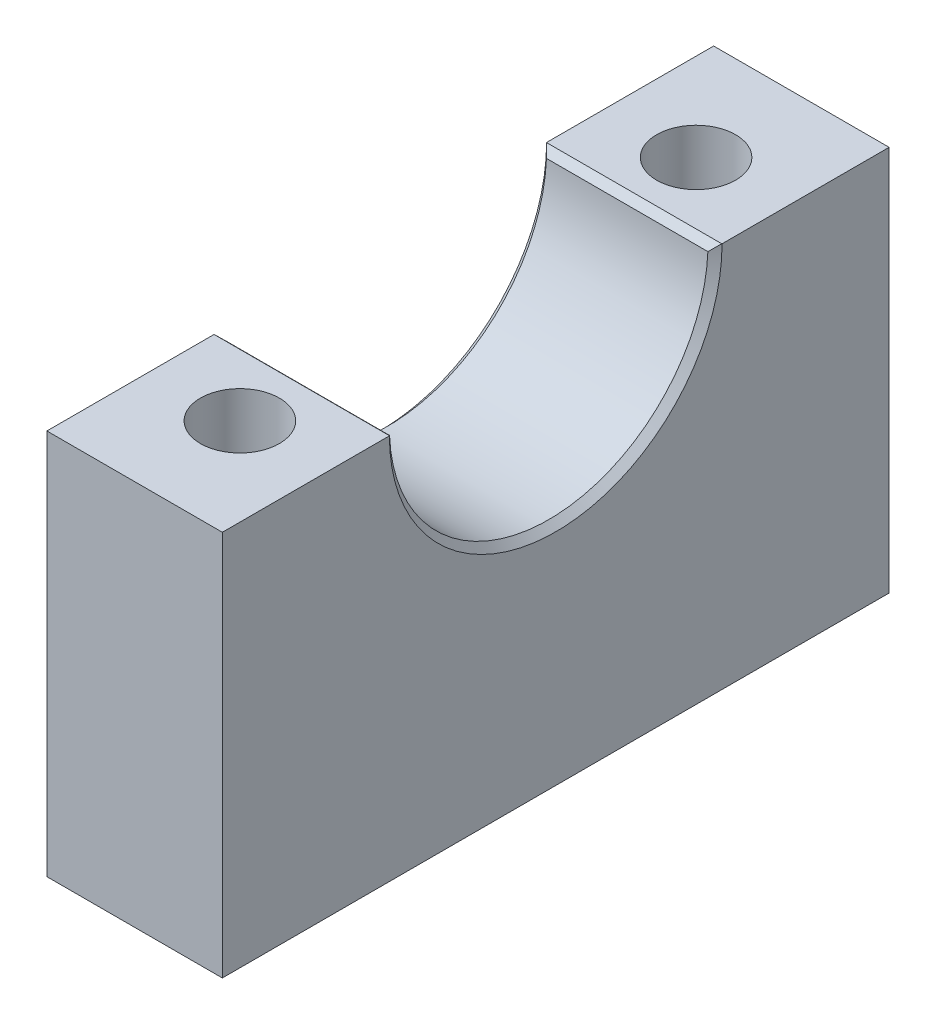
ISO-10303-21;
HEADER;
FILE_DESCRIPTION(('STEP AP214'),'2;1');
FILE_NAME('part.step','',(''),(''),'','','');
FILE_SCHEMA(('AUTOMOTIVE_DESIGN { 1 0 10303 214 1 1 1 1 }'));
ENDSEC;
DATA;
#1=APPLICATION_CONTEXT('core data for automotive mechanical design processes');
#2=APPLICATION_PROTOCOL_DEFINITION('international standard','automotive_design',2000,#1);
#3=PRODUCT_CONTEXT('',#1,'mechanical');
#4=PRODUCT('Part','Part','',(#3));
#5=PRODUCT_RELATED_PRODUCT_CATEGORY('part','',(#4));
#6=PRODUCT_DEFINITION_FORMATION('','',#4);
#7=PRODUCT_DEFINITION_CONTEXT('part definition',#1,'design');
#8=PRODUCT_DEFINITION('design','',#6,#7);
#9=PRODUCT_DEFINITION_SHAPE('','',#8);
#10=(LENGTH_UNIT() NAMED_UNIT(*) SI_UNIT(.MILLI.,.METRE.));
#11=(NAMED_UNIT(*) PLANE_ANGLE_UNIT() SI_UNIT($,.RADIAN.));
#12=(NAMED_UNIT(*) SI_UNIT($,.STERADIAN.) SOLID_ANGLE_UNIT());
#13=UNCERTAINTY_MEASURE_WITH_UNIT(LENGTH_MEASURE(1.E-05),#10,'distance_accuracy_value','');
#14=(GEOMETRIC_REPRESENTATION_CONTEXT(3) GLOBAL_UNCERTAINTY_ASSIGNED_CONTEXT((#13)) GLOBAL_UNIT_ASSIGNED_CONTEXT((#10,
#11,#12)) REPRESENTATION_CONTEXT('',''));
#15=CARTESIAN_POINT('',(0.,0.,0.));
#16=DIRECTION('',(0.,0.,1.));
#17=DIRECTION('',(1.,0.,0.));
#18=AXIS2_PLACEMENT_3D('',#15,#16,#17);
#19=CARTESIAN_POINT('',(15.875,0.,0.));
#20=DIRECTION('',(-1.,0.,0.));
#21=DIRECTION('',(0.,0.,1.));
#22=AXIS2_PLACEMENT_3D('',#19,#20,#21);
#23=CYLINDRICAL_SURFACE('',#22,14.4145);
#24=CARTESIAN_POINT('',(15.24,0.,0.));
#25=DIRECTION('',(1.,0.,0.));
#26=DIRECTION('',(0.,0.,-1.));
#27=AXIS2_PLACEMENT_3D('',#24,#25,#26);
#28=CIRCLE('',#27,14.4145);
#29=CARTESIAN_POINT('',(15.24,-0.608206751054859,14.4016629178012));
#30=VERTEX_POINT('',#29);
#31=CARTESIAN_POINT('',(15.24,-0.608206751054859,-14.4016629178012));
#32=VERTEX_POINT('',#31);
#33=EDGE_CURVE('E180',#30,#32,#28,.T.);
#34=ORIENTED_EDGE('',*,*,#33,.T.);
#35=DIRECTION('',(-1.,0.,0.));
#36=VECTOR('',#35,1.);
#37=CARTESIAN_POINT('',(15.875,-0.608206751054859,-14.4016629178012));
#38=LINE('',#37,#36);
#39=CARTESIAN_POINT('',(0.635000000000006,-0.608206751054859,-14.4016629178012));
#40=VERTEX_POINT('',#39);
#41=EDGE_CURVE('E182',#32,#40,#38,.T.);
#42=ORIENTED_EDGE('',*,*,#41,.T.);
#43=CARTESIAN_POINT('',(0.635000000000005,0.,0.));
#44=DIRECTION('',(1.,0.,0.));
#45=DIRECTION('',(0.,0.,-1.));
#46=AXIS2_PLACEMENT_3D('',#43,#44,#45);
#47=CIRCLE('',#46,14.4145);
#48=CARTESIAN_POINT('',(0.635000000000006,-0.608206751054859,14.4016629178012));
#49=VERTEX_POINT('',#48);
#50=EDGE_CURVE('E135',#40,#49,#47,.F.);
#51=ORIENTED_EDGE('',*,*,#50,.T.);
#52=DIRECTION('',(-1.,0.,0.));
#53=VECTOR('',#52,1.);
#54=CARTESIAN_POINT('',(15.875,-0.608206751054859,14.4016629178012));
#55=LINE('',#54,#53);
#56=EDGE_CURVE('E178',#49,#30,#55,.F.);
#57=ORIENTED_EDGE('',*,*,#56,.T.);
#58=EDGE_LOOP('',(#34,#42,#51,#57));
#59=FACE_BOUND('',#58,.T.);
#60=ADVANCED_FACE('F45',(#59),#23,.F.);
#61=CARTESIAN_POINT('',(15.875,0.,0.));
#62=DIRECTION('',(0.,1.,0.));
#63=DIRECTION('',(0.,0.,1.));
#64=AXIS2_PLACEMENT_3D('',#61,#62,#63);
#65=PLANE('',#64);
#66=CARTESIAN_POINT('',(7.93750000000001,0.,20.6375));
#67=DIRECTION('',(0.,1.,0.));
#68=DIRECTION('',(0.,0.,1.));
#69=AXIS2_PLACEMENT_3D('',#66,#67,#68);
#70=CIRCLE('',#69,3.57123999999999);
#71=CARTESIAN_POINT('',(7.93750000000001,0.,24.20874));
#72=VERTEX_POINT('',#71);
#73=EDGE_CURVE('E275',#72,#72,#70,.T.);
#74=ORIENTED_EDGE('',*,*,#73,.F.);
#75=EDGE_LOOP('',(#74));
#76=FACE_BOUND('',#75,.T.);
#77=DIRECTION('',(0.,0.,-1.));
#78=VECTOR('',#77,1.);
#79=CARTESIAN_POINT('',(15.875,0.,0.));
#80=LINE('',#79,#78);
#81=CARTESIAN_POINT('',(15.875,0.,30.1625));
#82=VERTEX_POINT('',#81);
#83=CARTESIAN_POINT('',(15.875,0.,15.0495));
#84=VERTEX_POINT('',#83);
#85=EDGE_CURVE('E128',#82,#84,#80,.T.);
#86=ORIENTED_EDGE('',*,*,#85,.T.);
#87=DIRECTION('',(0.707106781186544,0.,0.707106781186551));
#88=VECTOR('',#87,1.);
#89=CARTESIAN_POINT('',(0.825500000000151,0.,0.));
#90=LINE('',#89,#88);
#91=CARTESIAN_POINT('',(15.8615974075722,0.,15.0360974075722));
#92=VERTEX_POINT('',#91);
#93=EDGE_CURVE('E60',#84,#92,#90,.F.);
#94=ORIENTED_EDGE('',*,*,#93,.T.);
#95=DIRECTION('',(-1.,0.,0.));
#96=VECTOR('',#95,1.);
#97=CARTESIAN_POINT('',(15.875,0.,15.0360974075722));
#98=LINE('',#97,#96);
#99=CARTESIAN_POINT('',(0.0134025924277796,0.,15.0360974075722));
#100=VERTEX_POINT('',#99);
#101=EDGE_CURVE('E71',#92,#100,#98,.T.);
#102=ORIENTED_EDGE('',*,*,#101,.T.);
#103=DIRECTION('',(0.707106781186544,0.,-0.707106781186551));
#104=VECTOR('',#103,1.);
#105=CARTESIAN_POINT('',(15.0494999999998,0.,0.));
#106=LINE('',#105,#104);
#107=CARTESIAN_POINT('',(0.,0.,15.0495));
#108=VERTEX_POINT('',#107);
#109=EDGE_CURVE('E193',#100,#108,#106,.F.);
#110=ORIENTED_EDGE('',*,*,#109,.T.);
#111=DIRECTION('',(0.,0.,-1.));
#112=VECTOR('',#111,1.);
#113=CARTESIAN_POINT('',(0.,0.,0.));
#114=LINE('',#113,#112);
#115=CARTESIAN_POINT('',(0.,0.,30.1625));
#116=VERTEX_POINT('',#115);
#117=EDGE_CURVE('E130',#116,#108,#114,.T.);
#118=ORIENTED_EDGE('',*,*,#117,.F.);
#119=DIRECTION('',(-1.,0.,0.));
#120=VECTOR('',#119,1.);
#121=CARTESIAN_POINT('',(15.875,0.,30.1625));
#122=LINE('',#121,#120);
#123=EDGE_CURVE('E125',#82,#116,#122,.T.);
#124=ORIENTED_EDGE('',*,*,#123,.F.);
#125=EDGE_LOOP('',(#86,#94,#102,#110,#118,#124));
#126=FACE_BOUND('',#125,.T.);
#127=ADVANCED_FACE('F127',(#76,#126),#65,.T.);
#128=CARTESIAN_POINT('',(15.875,0.,30.1625));
#129=DIRECTION('',(0.,0.,1.));
#130=DIRECTION('',(1.,0.,0.));
#131=AXIS2_PLACEMENT_3D('',#128,#129,#130);
#132=PLANE('',#131);
#133=DIRECTION('',(0.,1.,0.));
#134=VECTOR('',#133,1.);
#135=CARTESIAN_POINT('',(0.,0.,30.1625));
#136=LINE('',#135,#134);
#137=CARTESIAN_POINT('',(0.,-34.925,30.1625));
#138=VERTEX_POINT('',#137);
#139=EDGE_CURVE('E159',#138,#116,#136,.T.);
#140=ORIENTED_EDGE('',*,*,#139,.F.);
#141=DIRECTION('',(-1.,0.,0.));
#142=VECTOR('',#141,1.);
#143=CARTESIAN_POINT('',(15.875,-34.925,30.1625));
#144=LINE('',#143,#142);
#145=CARTESIAN_POINT('',(15.875,-34.925,30.1625));
#146=VERTEX_POINT('',#145);
#147=EDGE_CURVE('E136',#146,#138,#144,.T.);
#148=ORIENTED_EDGE('',*,*,#147,.F.);
#149=DIRECTION('',(0.,1.,0.));
#150=VECTOR('',#149,1.);
#151=CARTESIAN_POINT('',(15.875,0.,30.1625));
#152=LINE('',#151,#150);
#153=EDGE_CURVE('E142',#146,#82,#152,.T.);
#154=ORIENTED_EDGE('',*,*,#153,.T.);
#155=ORIENTED_EDGE('',*,*,#123,.T.);
#156=EDGE_LOOP('',(#140,#148,#154,#155));
#157=FACE_BOUND('',#156,.T.);
#158=ADVANCED_FACE('F148',(#157),#132,.T.);
#159=CARTESIAN_POINT('',(15.875,-34.925,0.));
#160=DIRECTION('',(0.,1.,0.));
#161=DIRECTION('',(0.,0.,1.));
#162=AXIS2_PLACEMENT_3D('',#159,#160,#161);
#163=PLANE('',#162);
#164=CARTESIAN_POINT('',(7.93750000000001,-34.925,20.6375));
#165=DIRECTION('',(0.,1.,0.));
#166=DIRECTION('',(0.,0.,1.));
#167=AXIS2_PLACEMENT_3D('',#164,#165,#166);
#168=CIRCLE('',#167,3.57123999999998);
#169=CARTESIAN_POINT('',(7.93750000000001,-34.925,24.20874));
#170=VERTEX_POINT('',#169);
#171=EDGE_CURVE('E278',#170,#170,#168,.T.);
#172=ORIENTED_EDGE('',*,*,#171,.T.);
#173=EDGE_LOOP('',(#172));
#174=FACE_BOUND('',#173,.T.);
#175=CARTESIAN_POINT('',(7.9375,-34.925,-20.6375));
#176=DIRECTION('',(0.,1.,0.));
#177=DIRECTION('',(0.,0.,1.));
#178=AXIS2_PLACEMENT_3D('',#175,#176,#177);
#179=CIRCLE('',#178,3.57123999999998);
#180=CARTESIAN_POINT('',(7.9375,-34.925,-17.06626));
#181=VERTEX_POINT('',#180);
#182=EDGE_CURVE('E176',#181,#181,#179,.T.);
#183=ORIENTED_EDGE('',*,*,#182,.T.);
#184=EDGE_LOOP('',(#183));
#185=FACE_BOUND('',#184,.T.);
#186=DIRECTION('',(0.,0.,-1.));
#187=VECTOR('',#186,1.);
#188=CARTESIAN_POINT('',(0.,-34.925,0.));
#189=LINE('',#188,#187);
#190=CARTESIAN_POINT('',(0.,-34.925,-30.1625));
#191=VERTEX_POINT('',#190);
#192=EDGE_CURVE('E162',#138,#191,#189,.T.);
#193=ORIENTED_EDGE('',*,*,#192,.T.);
#194=DIRECTION('',(-1.,0.,0.));
#195=VECTOR('',#194,1.);
#196=CARTESIAN_POINT('',(15.875,-34.925,-30.1625));
#197=LINE('',#196,#195);
#198=CARTESIAN_POINT('',(15.875,-34.925,-30.1625));
#199=VERTEX_POINT('',#198);
#200=EDGE_CURVE('E170',#199,#191,#197,.T.);
#201=ORIENTED_EDGE('',*,*,#200,.F.);
#202=DIRECTION('',(0.,0.,-1.));
#203=VECTOR('',#202,1.);
#204=CARTESIAN_POINT('',(15.875,-34.925,0.));
#205=LINE('',#204,#203);
#206=EDGE_CURVE('E150',#146,#199,#205,.T.);
#207=ORIENTED_EDGE('',*,*,#206,.F.);
#208=ORIENTED_EDGE('',*,*,#147,.T.);
#209=EDGE_LOOP('',(#193,#201,#207,#208));
#210=FACE_BOUND('',#209,.T.);
#211=ADVANCED_FACE('F249',(#174,#185,#210),#163,.F.);
#212=CARTESIAN_POINT('',(15.875,0.,-30.1625));
#213=DIRECTION('',(0.,0.,1.));
#214=DIRECTION('',(1.,0.,0.));
#215=AXIS2_PLACEMENT_3D('',#212,#213,#214);
#216=PLANE('',#215);
#217=DIRECTION('',(0.,1.,0.));
#218=VECTOR('',#217,1.);
#219=CARTESIAN_POINT('',(0.,0.,-30.1625));
#220=LINE('',#219,#218);
#221=CARTESIAN_POINT('',(0.,0.,-30.1625));
#222=VERTEX_POINT('',#221);
#223=EDGE_CURVE('E164',#191,#222,#220,.T.);
#224=ORIENTED_EDGE('',*,*,#223,.T.);
#225=DIRECTION('',(-1.,0.,0.));
#226=VECTOR('',#225,1.);
#227=CARTESIAN_POINT('',(15.875,0.,-30.1625));
#228=LINE('',#227,#226);
#229=CARTESIAN_POINT('',(15.875,0.,-30.1625));
#230=VERTEX_POINT('',#229);
#231=EDGE_CURVE('E167',#230,#222,#228,.T.);
#232=ORIENTED_EDGE('',*,*,#231,.F.);
#233=DIRECTION('',(0.,1.,0.));
#234=VECTOR('',#233,1.);
#235=CARTESIAN_POINT('',(15.875,0.,-30.1625));
#236=LINE('',#235,#234);
#237=EDGE_CURVE('E152',#199,#230,#236,.T.);
#238=ORIENTED_EDGE('',*,*,#237,.F.);
#239=ORIENTED_EDGE('',*,*,#200,.T.);
#240=EDGE_LOOP('',(#224,#232,#238,#239));
#241=FACE_BOUND('',#240,.T.);
#242=ADVANCED_FACE('F252',(#241),#216,.F.);
#243=CARTESIAN_POINT('',(7.9375,0.,-20.6375));
#244=DIRECTION('',(0.,1.,0.));
#245=DIRECTION('',(0.,0.,1.));
#246=AXIS2_PLACEMENT_3D('',#243,#244,#245);
#247=CIRCLE('',#246,3.57123999999999);
#248=CARTESIAN_POINT('',(7.9375,0.,-17.06626));
#249=VERTEX_POINT('',#248);
#250=EDGE_CURVE('E160',#249,#249,#247,.T.);
#251=ORIENTED_EDGE('',*,*,#250,.F.);
#252=EDGE_LOOP('',(#251));
#253=FACE_BOUND('',#252,.T.);
#254=DIRECTION('',(1.,0.,0.));
#255=VECTOR('',#254,1.);
#256=CARTESIAN_POINT('',(15.875,0.,-15.0360974075722));
#257=LINE('',#256,#255);
#258=CARTESIAN_POINT('',(0.0134025924277796,0.,-15.0360974075722));
#259=VERTEX_POINT('',#258);
#260=CARTESIAN_POINT('',(15.8615974075722,0.,-15.0360974075722));
#261=VERTEX_POINT('',#260);
#262=EDGE_CURVE('E187',#259,#261,#257,.T.);
#263=ORIENTED_EDGE('',*,*,#262,.T.);
#264=DIRECTION('',(-0.707106781186544,0.,0.707106781186551));
#265=VECTOR('',#264,1.);
#266=CARTESIAN_POINT('',(0.825500000000151,0.,0.));
#267=LINE('',#266,#265);
#268=CARTESIAN_POINT('',(15.875,0.,-15.0495));
#269=VERTEX_POINT('',#268);
#270=EDGE_CURVE('E190',#261,#269,#267,.F.);
#271=ORIENTED_EDGE('',*,*,#270,.T.);
#272=EDGE_CURVE('E147',#269,#230,#80,.T.);
#273=ORIENTED_EDGE('',*,*,#272,.T.);
#274=ORIENTED_EDGE('',*,*,#231,.T.);
#275=CARTESIAN_POINT('',(0.,0.,-15.0495));
#276=VERTEX_POINT('',#275);
#277=EDGE_CURVE('E145',#276,#222,#114,.T.);
#278=ORIENTED_EDGE('',*,*,#277,.F.);
#279=DIRECTION('',(-0.707106781186544,0.,-0.707106781186551));
#280=VECTOR('',#279,1.);
#281=CARTESIAN_POINT('',(15.0494999999998,0.,0.));
#282=LINE('',#281,#280);
#283=EDGE_CURVE('E185',#276,#259,#282,.F.);
#284=ORIENTED_EDGE('',*,*,#283,.T.);
#285=EDGE_LOOP('',(#263,#271,#273,#274,#278,#284));
#286=FACE_BOUND('',#285,.T.);
#287=ADVANCED_FACE('F245',(#253,#286),#65,.T.);
#288=CARTESIAN_POINT('',(15.875,0.,0.));
#289=DIRECTION('',(1.,0.,0.));
#290=DIRECTION('',(0.,0.,-1.));
#291=AXIS2_PLACEMENT_3D('',#288,#289,#290);
#292=PLANE('',#291);
#293=ORIENTED_EDGE('',*,*,#272,.F.);
#294=CARTESIAN_POINT('',(15.875,0.,0.));
#295=DIRECTION('',(1.,0.,0.));
#296=DIRECTION('',(0.,0.,-1.));
#297=AXIS2_PLACEMENT_3D('',#294,#295,#296);
#298=CIRCLE('',#297,15.0495);
#299=EDGE_CURVE('E144',#269,#84,#298,.F.);
#300=ORIENTED_EDGE('',*,*,#299,.T.);
#301=ORIENTED_EDGE('',*,*,#85,.F.);
#302=ORIENTED_EDGE('',*,*,#153,.F.);
#303=ORIENTED_EDGE('',*,*,#206,.T.);
#304=ORIENTED_EDGE('',*,*,#237,.T.);
#305=EDGE_LOOP('',(#293,#300,#301,#302,#303,#304));
#306=FACE_BOUND('',#305,.T.);
#307=ADVANCED_FACE('F141',(#306),#292,.T.);
#308=CARTESIAN_POINT('',(0.,0.,0.));
#309=DIRECTION('',(1.,0.,0.));
#310=DIRECTION('',(0.,0.,-1.));
#311=AXIS2_PLACEMENT_3D('',#308,#309,#310);
#312=PLANE('',#311);
#313=ORIENTED_EDGE('',*,*,#117,.T.);
#314=CARTESIAN_POINT('',(0.,0.,0.));
#315=DIRECTION('',(1.,0.,0.));
#316=DIRECTION('',(0.,0.,-1.));
#317=AXIS2_PLACEMENT_3D('',#314,#315,#316);
#318=CIRCLE('',#317,15.0495);
#319=EDGE_CURVE('E12',#108,#276,#318,.T.);
#320=ORIENTED_EDGE('',*,*,#319,.T.);
#321=ORIENTED_EDGE('',*,*,#277,.T.);
#322=ORIENTED_EDGE('',*,*,#223,.F.);
#323=ORIENTED_EDGE('',*,*,#192,.F.);
#324=ORIENTED_EDGE('',*,*,#139,.T.);
#325=EDGE_LOOP('',(#313,#320,#321,#322,#323,#324));
#326=FACE_BOUND('',#325,.T.);
#327=ADVANCED_FACE('F259',(#326),#312,.F.);
#328=CARTESIAN_POINT('',(7.9375,34.925,-20.6375));
#329=DIRECTION('',(0.,1.,0.));
#330=DIRECTION('',(0.,0.,1.));
#331=AXIS2_PLACEMENT_3D('',#328,#329,#330);
#332=CYLINDRICAL_SURFACE('',#331,3.57123999999999);
#333=ORIENTED_EDGE('',*,*,#250,.T.);
#334=EDGE_LOOP('',(#333));
#335=FACE_BOUND('',#334,.T.);
#336=ORIENTED_EDGE('',*,*,#182,.F.);
#337=EDGE_LOOP('',(#336));
#338=FACE_BOUND('',#337,.T.);
#339=ADVANCED_FACE('F262',(#335,#338),#332,.F.);
#340=CARTESIAN_POINT('',(7.93750000000001,34.925,20.6375));
#341=DIRECTION('',(0.,1.,0.));
#342=DIRECTION('',(0.,0.,1.));
#343=AXIS2_PLACEMENT_3D('',#340,#341,#342);
#344=CYLINDRICAL_SURFACE('',#343,3.57123999999999);
#345=ORIENTED_EDGE('',*,*,#73,.T.);
#346=EDGE_LOOP('',(#345));
#347=FACE_BOUND('',#346,.T.);
#348=ORIENTED_EDGE('',*,*,#171,.F.);
#349=EDGE_LOOP('',(#348));
#350=FACE_BOUND('',#349,.T.);
#351=ADVANCED_FACE('F235',(#347,#350),#344,.F.);
#352=CARTESIAN_POINT('',(15.875,0.,15.0360974075722));
#353=DIRECTION('',(0.,-0.721870519146964,0.692028145082621));
#354=DIRECTION('',(-1.,0.,0.));
#355=AXIS2_PLACEMENT_3D('',#352,#353,#354);
#356=PLANE('',#355);
#357=CARTESIAN_POINT('',(0.0134025924277812,0.,15.0360974075722));
#358=CARTESIAN_POINT('',(0.0659094272433914,-0.0503363643994964,14.9835903849038));
#359=CARTESIAN_POINT('',(0.118250385734318,-0.100755667495606,14.9309968469681));
#360=CARTESIAN_POINT('',(0.222583333504489,-0.201764996806373,14.825631685874));
#361=CARTESIAN_POINT('',(0.274575331376772,-0.252355018770693,14.7728600671493));
#362=CARTESIAN_POINT('',(0.37819581947475,-0.353713198434636,14.667131012206));
#363=CARTESIAN_POINT('',(0.429824309131529,-0.404481356412868,14.6141735756966));
#364=CARTESIAN_POINT('',(0.532701597847225,-0.506203430976733,14.5080649335902));
#365=CARTESIAN_POINT('',(0.583950387489736,-0.557157352122771,14.4549137232361));
#366=CARTESIAN_POINT('',(0.635000000000007,-0.608206751054858,14.4016629178012));
#367=B_SPLINE_CURVE_WITH_KNOTS('',3,(#357,#358,#359,#360,#361,#362,#363,#364,#365,#366),
.UNSPECIFIED.,.F.,.F.,(4,2,2,2,4),(0.,0.269126892982657,0.538247134310665,0.807367796737204,
1.07649511105642),.UNSPECIFIED.);
#368=EDGE_CURVE('E282',#100,#49,#367,.T.);
#369=ORIENTED_EDGE('',*,*,#368,.F.);
#370=ORIENTED_EDGE('',*,*,#101,.F.);
#371=CARTESIAN_POINT('',(15.8615974075722,0.,15.0360974075722));
#372=CARTESIAN_POINT('',(15.8090905727566,-0.0503363643994971,14.9835903849038));
#373=CARTESIAN_POINT('',(15.7567496142657,-0.100755667495607,14.9309968469681));
#374=CARTESIAN_POINT('',(15.6524166664955,-0.201764996806374,14.825631685874));
#375=CARTESIAN_POINT('',(15.6004246686232,-0.252355018770693,14.7728600671493));
#376=CARTESIAN_POINT('',(15.4968041805253,-0.353713198434636,14.667131012206));
#377=CARTESIAN_POINT('',(15.4451756908685,-0.404481356412868,14.6141735756966));
#378=CARTESIAN_POINT('',(15.3422984021528,-0.506203430976734,14.5080649335902));
#379=CARTESIAN_POINT('',(15.2910496125103,-0.557157352122772,14.4549137232361));
#380=CARTESIAN_POINT('',(15.24,-0.608206751054858,14.4016629178012));
#381=B_SPLINE_CURVE_WITH_KNOTS('',3,(#371,#372,#373,#374,#375,#376,#377,#378,#379,#380),
.UNSPECIFIED.,.F.,.F.,(4,2,2,2,4),(0.,0.269126892982658,0.538247134310667,0.807367796737205,
1.07649511105642),.UNSPECIFIED.);
#382=EDGE_CURVE('E51',#30,#92,#381,.F.);
#383=ORIENTED_EDGE('',*,*,#382,.F.);
#384=ORIENTED_EDGE('',*,*,#56,.F.);
#385=EDGE_LOOP('',(#369,#370,#383,#384));
#386=FACE_BOUND('',#385,.T.);
#387=ADVANCED_FACE('F48',(#386),#356,.F.);
#388=CARTESIAN_POINT('',(15.24,0.,0.));
#389=DIRECTION('',(1.,0.,0.));
#390=DIRECTION('',(0.,0.,-1.));
#391=AXIS2_PLACEMENT_3D('',#388,#389,#390);
#392=CONICAL_SURFACE('',#391,14.4145,0.785398163397454);
#393=ORIENTED_EDGE('',*,*,#299,.F.);
#394=ORIENTED_EDGE('',*,*,#270,.F.);
#395=CARTESIAN_POINT('',(15.8615974075722,0.,-15.0360974075722));
#396=CARTESIAN_POINT('',(15.8090905727566,-0.0503363643994971,-14.9835903849038));
#397=CARTESIAN_POINT('',(15.7567496142657,-0.100755667495607,-14.9309968469681));
#398=CARTESIAN_POINT('',(15.6524166664955,-0.201764996806374,-14.825631685874));
#399=CARTESIAN_POINT('',(15.6004246686232,-0.252355018770693,-14.7728600671493));
#400=CARTESIAN_POINT('',(15.4968041805252,-0.353713198434636,-14.667131012206));
#401=CARTESIAN_POINT('',(15.4451756908685,-0.404481356412868,-14.6141735756966));
#402=CARTESIAN_POINT('',(15.3422984021528,-0.506203430976734,-14.5080649335902));
#403=CARTESIAN_POINT('',(15.2910496125103,-0.557157352122772,-14.4549137232361));
#404=CARTESIAN_POINT('',(15.24,-0.608206751054858,-14.4016629178012));
#405=B_SPLINE_CURVE_WITH_KNOTS('',3,(#395,#396,#397,#398,#399,#400,#401,#402,#403,#404),
.UNSPECIFIED.,.F.,.F.,(4,2,2,2,4),(0.,0.269126892982658,0.538247134310667,0.807367796737205,
1.07649511105642),.UNSPECIFIED.);
#406=EDGE_CURVE('E205',#32,#261,#405,.F.);
#407=ORIENTED_EDGE('',*,*,#406,.F.);
#408=ORIENTED_EDGE('',*,*,#33,.F.);
#409=ORIENTED_EDGE('',*,*,#382,.T.);
#410=ORIENTED_EDGE('',*,*,#93,.F.);
#411=EDGE_LOOP('',(#393,#394,#407,#408,#409,#410));
#412=FACE_BOUND('',#411,.T.);
#413=ADVANCED_FACE('F222',(#412),#392,.F.);
#414=CARTESIAN_POINT('',(0.,0.,0.));
#415=DIRECTION('',(-1.,0.,0.));
#416=DIRECTION('',(0.,0.,1.));
#417=AXIS2_PLACEMENT_3D('',#414,#415,#416);
#418=CONICAL_SURFACE('',#417,15.0495,0.785398163397454);
#419=ORIENTED_EDGE('',*,*,#368,.T.);
#420=ORIENTED_EDGE('',*,*,#50,.F.);
#421=CARTESIAN_POINT('',(0.635000000000006,-0.608206751054859,-14.4016629178012));
#422=CARTESIAN_POINT('',(0.583950387489736,-0.557157352122771,-14.4549137232361));
#423=CARTESIAN_POINT('',(0.532701597847225,-0.506203430976733,-14.5080649335902));
#424=CARTESIAN_POINT('',(0.429824309131529,-0.404481356412868,-14.6141735756966));
#425=CARTESIAN_POINT('',(0.37819581947475,-0.353713198434636,-14.667131012206));
#426=CARTESIAN_POINT('',(0.274575331376772,-0.252355018770693,-14.7728600671493));
#427=CARTESIAN_POINT('',(0.222583333504489,-0.201764996806373,-14.825631685874));
#428=CARTESIAN_POINT('',(0.118250385734318,-0.100755667495606,-14.9309968469681));
#429=CARTESIAN_POINT('',(0.0659094272433916,-0.0503363643994961,-14.9835903849038));
#430=CARTESIAN_POINT('',(0.0134025924277817,0.,-15.0360974075722));
#431=B_SPLINE_CURVE_WITH_KNOTS('',3,(#421,#422,#423,#424,#425,#426,#427,#428,#429,#430),
.UNSPECIFIED.,.F.,.F.,(4,2,2,2,4),(0.,0.269127314319214,0.538247976745753,0.807368218073762,
1.07649511105642),.UNSPECIFIED.);
#432=EDGE_CURVE('E197',#259,#40,#431,.F.);
#433=ORIENTED_EDGE('',*,*,#432,.F.);
#434=ORIENTED_EDGE('',*,*,#283,.F.);
#435=ORIENTED_EDGE('',*,*,#319,.F.);
#436=ORIENTED_EDGE('',*,*,#109,.F.);
#437=EDGE_LOOP('',(#419,#420,#433,#434,#435,#436));
#438=FACE_BOUND('',#437,.T.);
#439=ADVANCED_FACE('F211',(#438),#418,.F.);
#440=CARTESIAN_POINT('',(15.875,-0.608206751054857,-14.4016629178012));
#441=DIRECTION('',(0.,-0.721870519146964,-0.692028145082621));
#442=DIRECTION('',(-1.,0.,0.));
#443=AXIS2_PLACEMENT_3D('',#440,#441,#442);
#444=PLANE('',#443);
#445=ORIENTED_EDGE('',*,*,#406,.T.);
#446=ORIENTED_EDGE('',*,*,#262,.F.);
#447=ORIENTED_EDGE('',*,*,#432,.T.);
#448=ORIENTED_EDGE('',*,*,#41,.F.);
#449=EDGE_LOOP('',(#445,#446,#447,#448));
#450=FACE_BOUND('',#449,.T.);
#451=ADVANCED_FACE('F215',(#450),#444,.F.);
#452=CLOSED_SHELL('',(#60,#127,#158,#211,#242,#287,#307,#327,#339,#351,#387,#413,#439,#451));
#453=MANIFOLD_SOLID_BREP('B2',#452);
#454=ADVANCED_BREP_SHAPE_REPRESENTATION('',(#18,#453),#14);
#455=SHAPE_DEFINITION_REPRESENTATION(#9,#454);
ENDSEC;
END-ISO-10303-21;
